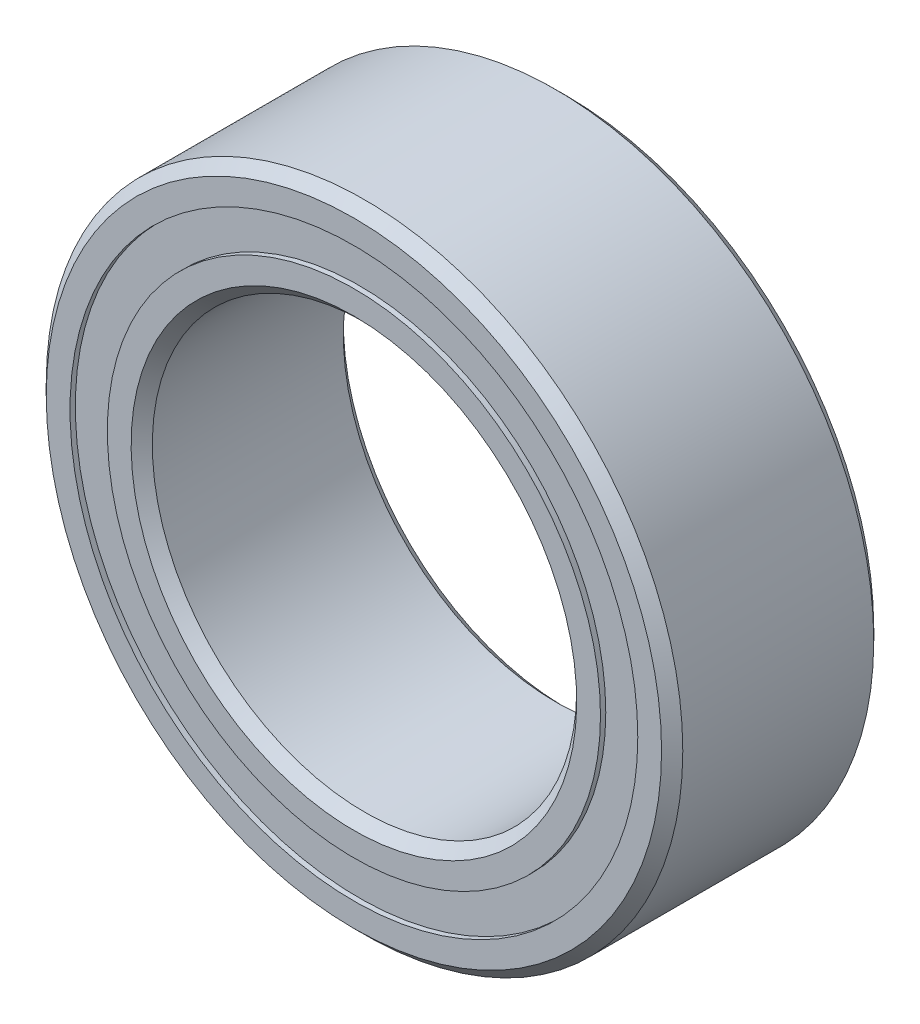
ISO-10303-21;
HEADER;
FILE_DESCRIPTION(('STEP AP214'),'2;1');
FILE_NAME('part.step','',(''),(''),'','','');
FILE_SCHEMA(('AUTOMOTIVE_DESIGN { 1 0 10303 214 1 1 1 1 }'));
ENDSEC;
DATA;
#1=APPLICATION_CONTEXT('core data for automotive mechanical design processes');
#2=APPLICATION_PROTOCOL_DEFINITION('international standard','automotive_design',2000,#1);
#3=PRODUCT_CONTEXT('',#1,'mechanical');
#4=PRODUCT('Part','Part','',(#3));
#5=PRODUCT_RELATED_PRODUCT_CATEGORY('part','',(#4));
#6=PRODUCT_DEFINITION_FORMATION('','',#4);
#7=PRODUCT_DEFINITION_CONTEXT('part definition',#1,'design');
#8=PRODUCT_DEFINITION('design','',#6,#7);
#9=PRODUCT_DEFINITION_SHAPE('','',#8);
#10=(LENGTH_UNIT() NAMED_UNIT(*) SI_UNIT(.MILLI.,.METRE.));
#11=(NAMED_UNIT(*) PLANE_ANGLE_UNIT() SI_UNIT($,.RADIAN.));
#12=(NAMED_UNIT(*) SI_UNIT($,.STERADIAN.) SOLID_ANGLE_UNIT());
#13=UNCERTAINTY_MEASURE_WITH_UNIT(LENGTH_MEASURE(1.E-05),#10,'distance_accuracy_value','');
#14=(GEOMETRIC_REPRESENTATION_CONTEXT(3) GLOBAL_UNCERTAINTY_ASSIGNED_CONTEXT((#13)) GLOBAL_UNIT_ASSIGNED_CONTEXT((#10,
#11,#12)) REPRESENTATION_CONTEXT('',''));
#15=CARTESIAN_POINT('',(0.,0.,0.));
#16=DIRECTION('',(0.,0.,1.));
#17=DIRECTION('',(1.,0.,0.));
#18=AXIS2_PLACEMENT_3D('',#15,#16,#17);
#19=CARTESIAN_POINT('',(-3.43703832126947,1.98437500000004,0.));
#20=DIRECTION('',(-0.866025403784433,0.50000000000001,0.));
#21=DIRECTION('',(0.,0.,1.));
#22=AXIS2_PLACEMENT_3D('',#19,#20,#21);
#23=SPHERICAL_SURFACE('',#22,0.758760243513404);
#24=CARTESIAN_POINT('',(-2.7799326750052,1.60499487824333,0.));
#25=VERTEX_POINT('',#24);
#26=VERTEX_LOOP('',#25);
#27=FACE_BOUND('',#26,.T.);
#28=CARTESIAN_POINT('',(-4.09414396753374,2.36375512175675,0.));
#29=VERTEX_POINT('',#28);
#30=VERTEX_LOOP('',#29);
#31=FACE_BOUND('',#30,.T.);
#32=ADVANCED_FACE('F46',(#27,#31),#23,.T.);
#33=CLOSED_SHELL('',(#32));
#34=MANIFOLD_SOLID_BREP('B2',#33);
#35=CARTESIAN_POINT('',(3.43703832126948,-1.98437500000002,0.));
#36=DIRECTION('',(0.866025403784437,-0.500000000000004,0.));
#37=DIRECTION('',(0.,0.,1.));
#38=AXIS2_PLACEMENT_3D('',#35,#36,#37);
#39=SPHERICAL_SURFACE('',#38,0.758760243513404);
#40=CARTESIAN_POINT('',(4.09414396753376,-2.36375512175672,0.));
#41=VERTEX_POINT('',#40);
#42=VERTEX_LOOP('',#41);
#43=FACE_BOUND('',#42,.T.);
#44=CARTESIAN_POINT('',(2.77993267500521,-1.60499487824331,0.));
#45=VERTEX_POINT('',#44);
#46=VERTEX_LOOP('',#45);
#47=FACE_BOUND('',#46,.T.);
#48=ADVANCED_FACE('F75',(#43,#47),#39,.T.);
#49=CLOSED_SHELL('',(#48));
#50=MANIFOLD_SOLID_BREP('B6',#49);
#51=CARTESIAN_POINT('',(3.96875,0.,0.));
#52=DIRECTION('',(1.,0.,0.));
#53=DIRECTION('',(0.,0.,1.));
#54=AXIS2_PLACEMENT_3D('',#51,#52,#53);
#55=SPHERICAL_SURFACE('',#54,0.758760243513404);
#56=CARTESIAN_POINT('',(3.2099897564866,0.,0.));
#57=VERTEX_POINT('',#56);
#58=VERTEX_LOOP('',#57);
#59=FACE_BOUND('',#58,.T.);
#60=CARTESIAN_POINT('',(4.7275102435134,0.,0.));
#61=VERTEX_POINT('',#60);
#62=VERTEX_LOOP('',#61);
#63=FACE_BOUND('',#62,.T.);
#64=ADVANCED_FACE('F104',(#59,#63),#55,.T.);
#65=CLOSED_SHELL('',(#64));
#66=MANIFOLD_SOLID_BREP('B39',#65);
#67=CARTESIAN_POINT('',(-1.98437500000003,-3.43703832126947,0.));
#68=DIRECTION('',(-0.500000000000007,-0.866025403784435,0.));
#69=DIRECTION('',(0.,0.,1.));
#70=AXIS2_PLACEMENT_3D('',#67,#68,#69);
#71=SPHERICAL_SURFACE('',#70,0.758760243513404);
#72=CARTESIAN_POINT('',(-1.60499487824332,-2.7799326750052,0.));
#73=VERTEX_POINT('',#72);
#74=VERTEX_LOOP('',#73);
#75=FACE_BOUND('',#74,.T.);
#76=CARTESIAN_POINT('',(-2.36375512175674,-4.09414396753375,0.));
#77=VERTEX_POINT('',#76);
#78=VERTEX_LOOP('',#77);
#79=FACE_BOUND('',#78,.T.);
#80=ADVANCED_FACE('F132',(#75,#79),#71,.T.);
#81=CLOSED_SHELL('',(#80));
#82=MANIFOLD_SOLID_BREP('B68',#81);
#83=CARTESIAN_POINT('',(0.,4.24787087912088,-0.758760243513404));
#84=DIRECTION('',(0.,0.,-1.));
#85=DIRECTION('',(1.,0.,0.));
#86=AXIS2_PLACEMENT_3D('',#83,#84,#85);
#87=PLANE('',#86);
#88=CARTESIAN_POINT('',(0.,0.,-0.758760243513404));
#89=DIRECTION('',(0.,0.,1.));
#90=DIRECTION('',(1.,0.,0.));
#91=AXIS2_PLACEMENT_3D('',#88,#89,#90);
#92=CIRCLE('',#91,3.68962912087912);
#93=CARTESIAN_POINT('',(3.68962912087912,0.,-0.758760243513404));
#94=VERTEX_POINT('',#93);
#95=EDGE_CURVE('E164',#94,#94,#92,.T.);
#96=ORIENTED_EDGE('',*,*,#95,.F.);
#97=EDGE_LOOP('',(#96));
#98=FACE_BOUND('',#97,.T.);
#99=CARTESIAN_POINT('',(0.,0.,-0.758760243513404));
#100=DIRECTION('',(0.,0.,1.));
#101=DIRECTION('',(1.,0.,0.));
#102=AXIS2_PLACEMENT_3D('',#99,#100,#101);
#103=CIRCLE('',#102,4.24787087912088);
#104=CARTESIAN_POINT('',(4.24787087912088,0.,-0.758760243513404));
#105=VERTEX_POINT('',#104);
#106=EDGE_CURVE('E173',#105,#105,#103,.T.);
#107=ORIENTED_EDGE('',*,*,#106,.T.);
#108=EDGE_LOOP('',(#107));
#109=FACE_BOUND('',#108,.T.);
#110=ADVANCED_FACE('F161',(#98,#109),#87,.F.);
#111=CARTESIAN_POINT('',(0.,0.,-1.5875));
#112=DIRECTION('',(0.,0.,-1.));
#113=DIRECTION('',(1.,0.,0.));
#114=AXIS2_PLACEMENT_3D('',#111,#112,#113);
#115=CYLINDRICAL_SURFACE('',#114,3.68962912087912);
#116=ORIENTED_EDGE('',*,*,#95,.T.);
#117=EDGE_LOOP('',(#116));
#118=FACE_BOUND('',#117,.T.);
#119=CARTESIAN_POINT('',(0.,0.,-1.508125));
#120=DIRECTION('',(0.,0.,1.));
#121=DIRECTION('',(1.,0.,0.));
#122=AXIS2_PLACEMENT_3D('',#119,#120,#121);
#123=CIRCLE('',#122,3.68962912087912);
#124=CARTESIAN_POINT('',(3.68962912087912,0.,-1.508125));
#125=VERTEX_POINT('',#124);
#126=EDGE_CURVE('E168',#125,#125,#123,.T.);
#127=ORIENTED_EDGE('',*,*,#126,.F.);
#128=EDGE_LOOP('',(#127));
#129=FACE_BOUND('',#128,.T.);
#130=ADVANCED_FACE('F181',(#118,#129),#115,.F.);
#131=CARTESIAN_POINT('',(0.,0.,-1.5875));
#132=DIRECTION('',(0.,0.,-1.));
#133=DIRECTION('',(1.,0.,0.));
#134=AXIS2_PLACEMENT_3D('',#131,#132,#133);
#135=CYLINDRICAL_SURFACE('',#134,4.24787087912088);
#136=CARTESIAN_POINT('',(0.,0.,-1.508125));
#137=DIRECTION('',(0.,0.,1.));
#138=DIRECTION('',(1.,0.,0.));
#139=AXIS2_PLACEMENT_3D('',#136,#137,#138);
#140=CIRCLE('',#139,4.24787087912088);
#141=CARTESIAN_POINT('',(4.24787087912088,0.,-1.508125));
#142=VERTEX_POINT('',#141);
#143=EDGE_CURVE('E131',#142,#142,#140,.F.);
#144=ORIENTED_EDGE('',*,*,#143,.F.);
#145=EDGE_LOOP('',(#144));
#146=FACE_BOUND('',#145,.T.);
#147=ORIENTED_EDGE('',*,*,#106,.F.);
#148=EDGE_LOOP('',(#147));
#149=FACE_BOUND('',#148,.T.);
#150=ADVANCED_FACE('F188',(#146,#149),#135,.T.);
#151=CARTESIAN_POINT('',(0.,4.24787087912088,-1.508125));
#152=DIRECTION('',(0.,0.,1.));
#153=DIRECTION('',(-1.,0.,0.));
#154=AXIS2_PLACEMENT_3D('',#151,#152,#153);
#155=PLANE('',#154);
#156=ORIENTED_EDGE('',*,*,#143,.T.);
#157=EDGE_LOOP('',(#156));
#158=FACE_BOUND('',#157,.T.);
#159=ORIENTED_EDGE('',*,*,#126,.T.);
#160=EDGE_LOOP('',(#159));
#161=FACE_BOUND('',#160,.T.);
#162=ADVANCED_FACE('F192',(#158,#161),#155,.F.);
#163=CLOSED_SHELL('',(#110,#130,#150,#162));
#164=MANIFOLD_SOLID_BREP('B97',#163);
#165=CARTESIAN_POINT('',(-3.43703832126951,-1.98437499999997,0.));
#166=DIRECTION('',(-0.866025403784443,-0.499999999999992,0.));
#167=DIRECTION('',(0.,0.,1.));
#168=AXIS2_PLACEMENT_3D('',#165,#166,#167);
#169=SPHERICAL_SURFACE('',#168,0.758760243513404);
#170=CARTESIAN_POINT('',(-4.09414396753379,-2.36375512175666,0.));
#171=VERTEX_POINT('',#170);
#172=VERTEX_LOOP('',#171);
#173=FACE_BOUND('',#172,.T.);
#174=CARTESIAN_POINT('',(-2.77993267500523,-1.60499487824327,0.));
#175=VERTEX_POINT('',#174);
#176=VERTEX_LOOP('',#175);
#177=FACE_BOUND('',#176,.T.);
#178=ADVANCED_FACE('F232',(#173,#177),#169,.T.);
#179=CLOSED_SHELL('',(#178));
#180=MANIFOLD_SOLID_BREP('B126',#179);
#181=CARTESIAN_POINT('',(-1.98437499999996,3.43703832126952,0.));
#182=DIRECTION('',(-0.499999999999989,0.866025403784445,0.));
#183=DIRECTION('',(0.,0.,1.));
#184=AXIS2_PLACEMENT_3D('',#181,#182,#183);
#185=SPHERICAL_SURFACE('',#184,0.758760243513404);
#186=CARTESIAN_POINT('',(-2.36375512175665,4.0941439675338,0.));
#187=VERTEX_POINT('',#186);
#188=VERTEX_LOOP('',#187);
#189=FACE_BOUND('',#188,.T.);
#190=CARTESIAN_POINT('',(-1.60499487824326,2.77993267500524,0.));
#191=VERTEX_POINT('',#190);
#192=VERTEX_LOOP('',#191);
#193=FACE_BOUND('',#192,.T.);
#194=ADVANCED_FACE('F261',(#189,#193),#185,.T.);
#195=CLOSED_SHELL('',(#194));
#196=MANIFOLD_SOLID_BREP('B154',#195);
#197=CARTESIAN_POINT('',(-3.96875,0.,0.));
#198=DIRECTION('',(-1.,0.,0.));
#199=DIRECTION('',(0.,0.,1.));
#200=AXIS2_PLACEMENT_3D('',#197,#198,#199);
#201=SPHERICAL_SURFACE('',#200,0.758760243513404);
#202=CARTESIAN_POINT('',(-4.7275102435134,0.,0.));
#203=VERTEX_POINT('',#202);
#204=VERTEX_LOOP('',#203);
#205=FACE_BOUND('',#204,.T.);
#206=CARTESIAN_POINT('',(-3.2099897564866,0.,0.));
#207=VERTEX_POINT('',#206);
#208=VERTEX_LOOP('',#207);
#209=FACE_BOUND('',#208,.T.);
#210=ADVANCED_FACE('F289',(#205,#209),#201,.T.);
#211=CLOSED_SHELL('',(#210));
#212=MANIFOLD_SOLID_BREP('B225',#211);
#213=CARTESIAN_POINT('',(0.,0.,0.));
#214=DIRECTION('',(0.,0.,-1.));
#215=DIRECTION('',(1.,0.,0.));
#216=AXIS2_PLACEMENT_3D('',#213,#214,#215);
#217=TOROIDAL_SURFACE('',#216,3.96875,0.758760243513404);
#218=CARTESIAN_POINT('',(0.,0.,0.705555555555556));
#219=DIRECTION('',(0.,0.,1.));
#220=DIRECTION('',(1.,0.,0.));
#221=AXIS2_PLACEMENT_3D('',#218,#219,#220);
#222=CIRCLE('',#221,4.24787087912088);
#223=CARTESIAN_POINT('',(4.24787087912088,0.,0.705555555555556));
#224=VERTEX_POINT('',#223);
#225=EDGE_CURVE('E336',#224,#224,#222,.F.);
#226=ORIENTED_EDGE('',*,*,#225,.F.);
#227=EDGE_LOOP('',(#226));
#228=FACE_BOUND('',#227,.T.);
#229=CARTESIAN_POINT('',(0.,0.,-0.705555555555555));
#230=DIRECTION('',(0.,0.,1.));
#231=DIRECTION('',(1.,0.,0.));
#232=AXIS2_PLACEMENT_3D('',#229,#230,#231);
#233=CIRCLE('',#232,4.24787087912088);
#234=CARTESIAN_POINT('',(4.24787087912088,0.,-0.705555555555555));
#235=VERTEX_POINT('',#234);
#236=EDGE_CURVE('E334',#235,#235,#233,.T.);
#237=ORIENTED_EDGE('',*,*,#236,.F.);
#238=EDGE_LOOP('',(#237));
#239=FACE_BOUND('',#238,.T.);
#240=ADVANCED_FACE('F318',(#228,#239),#217,.F.);
#241=CARTESIAN_POINT('',(0.,0.,-1.5875));
#242=DIRECTION('',(0.,0.,-1.));
#243=DIRECTION('',(1.,0.,0.));
#244=AXIS2_PLACEMENT_3D('',#241,#242,#243);
#245=CYLINDRICAL_SURFACE('',#244,4.24787087912088);
#246=CARTESIAN_POINT('',(0.,0.,1.5875));
#247=DIRECTION('',(0.,0.,1.));
#248=DIRECTION('',(1.,0.,0.));
#249=AXIS2_PLACEMENT_3D('',#246,#247,#248);
#250=CIRCLE('',#249,4.24787087912088);
#251=CARTESIAN_POINT('',(4.24787087912088,0.,1.5875));
#252=VERTEX_POINT('',#251);
#253=EDGE_CURVE('E322',#252,#252,#250,.F.);
#254=ORIENTED_EDGE('',*,*,#253,.F.);
#255=EDGE_LOOP('',(#254));
#256=FACE_BOUND('',#255,.T.);
#257=ORIENTED_EDGE('',*,*,#225,.T.);
#258=EDGE_LOOP('',(#257));
#259=FACE_BOUND('',#258,.T.);
#260=ADVANCED_FACE('F355',(#256,#259),#245,.F.);
#261=CARTESIAN_POINT('',(0.,0.,-1.5875));
#262=DIRECTION('',(0.,0.,-1.));
#263=DIRECTION('',(1.,0.,0.));
#264=AXIS2_PLACEMENT_3D('',#261,#262,#263);
#265=CYLINDRICAL_SURFACE('',#264,4.24787087912088);
#266=ORIENTED_EDGE('',*,*,#236,.T.);
#267=EDGE_LOOP('',(#266));
#268=FACE_BOUND('',#267,.T.);
#269=CARTESIAN_POINT('',(0.,0.,-1.5875));
#270=DIRECTION('',(0.,0.,1.));
#271=DIRECTION('',(1.,0.,0.));
#272=AXIS2_PLACEMENT_3D('',#269,#270,#271);
#273=CIRCLE('',#272,4.24787087912088);
#274=CARTESIAN_POINT('',(4.24787087912088,0.,-1.5875));
#275=VERTEX_POINT('',#274);
#276=EDGE_CURVE('E345',#275,#275,#273,.T.);
#277=ORIENTED_EDGE('',*,*,#276,.F.);
#278=EDGE_LOOP('',(#277));
#279=FACE_BOUND('',#278,.T.);
#280=ADVANCED_FACE('F358',(#268,#279),#265,.F.);
#281=CARTESIAN_POINT('',(0.,4.60375,1.5875));
#282=DIRECTION('',(0.,0.,-1.));
#283=DIRECTION('',(1.,0.,0.));
#284=AXIS2_PLACEMENT_3D('',#281,#282,#283);
#285=PLANE('',#284);
#286=ORIENTED_EDGE('',*,*,#253,.T.);
#287=EDGE_LOOP('',(#286));
#288=FACE_BOUND('',#287,.T.);
#289=CARTESIAN_POINT('',(0.,0.,1.58750000002783));
#290=DIRECTION('',(0.,0.,1.));
#291=DIRECTION('',(1.,0.,0.));
#292=AXIS2_PLACEMENT_3D('',#289,#290,#291);
#293=CIRCLE('',#292,4.60375000000113);
#294=CARTESIAN_POINT('',(4.60375000000113,0.,1.58750000002783));
#295=VERTEX_POINT('',#294);
#296=EDGE_CURVE('E343',#295,#295,#293,.T.);
#297=ORIENTED_EDGE('',*,*,#296,.T.);
#298=EDGE_LOOP('',(#297));
#299=FACE_BOUND('',#298,.T.);
#300=ADVANCED_FACE('F352',(#288,#299),#285,.F.);
#301=CARTESIAN_POINT('',(0.,4.60375,-1.5875));
#302=DIRECTION('',(0.,0.,1.));
#303=DIRECTION('',(-1.,0.,0.));
#304=AXIS2_PLACEMENT_3D('',#301,#302,#303);
#305=PLANE('',#304);
#306=CARTESIAN_POINT('',(0.,0.,-1.58750000008467));
#307=DIRECTION('',(0.,0.,-1.));
#308=DIRECTION('',(-1.,0.,0.));
#309=AXIS2_PLACEMENT_3D('',#306,#307,#308);
#310=CIRCLE('',#309,4.60375000000113);
#311=CARTESIAN_POINT('',(-4.60375000000113,0.,-1.58750000008467));
#312=VERTEX_POINT('',#311);
#313=EDGE_CURVE('E331',#312,#312,#310,.T.);
#314=ORIENTED_EDGE('',*,*,#313,.T.);
#315=EDGE_LOOP('',(#314));
#316=FACE_BOUND('',#315,.T.);
#317=ORIENTED_EDGE('',*,*,#276,.T.);
#318=EDGE_LOOP('',(#317));
#319=FACE_BOUND('',#318,.T.);
#320=ADVANCED_FACE('F371',(#316,#319),#305,.F.);
#321=CARTESIAN_POINT('',(0.,0.,1.42874999994547));
#322=DIRECTION('',(0.,0.,-1.));
#323=DIRECTION('',(1.,0.,0.));
#324=AXIS2_PLACEMENT_3D('',#321,#322,#323);
#325=CONICAL_SURFACE('',#324,4.76250000002665,0.785398163218414);
#326=CARTESIAN_POINT('',(0.,0.,1.42875));
#327=DIRECTION('',(0.,0.,1.));
#328=DIRECTION('',(1.,0.,0.));
#329=AXIS2_PLACEMENT_3D('',#326,#327,#328);
#330=CIRCLE('',#329,4.7625);
#331=CARTESIAN_POINT('',(4.7625,0.,1.42875));
#332=VERTEX_POINT('',#331);
#333=EDGE_CURVE('E326',#332,#332,#330,.T.);
#334=ORIENTED_EDGE('',*,*,#333,.T.);
#335=EDGE_LOOP('',(#334));
#336=FACE_BOUND('',#335,.T.);
#337=ORIENTED_EDGE('',*,*,#296,.F.);
#338=EDGE_LOOP('',(#337));
#339=FACE_BOUND('',#338,.T.);
#340=ADVANCED_FACE('F376',(#336,#339),#325,.T.);
#341=CARTESIAN_POINT('',(0.,0.,-1.42875000005915));
#342=DIRECTION('',(0.,0.,1.));
#343=DIRECTION('',(-1.,0.,0.));
#344=AXIS2_PLACEMENT_3D('',#341,#342,#343);
#345=CONICAL_SURFACE('',#344,4.7624999999698,0.785398163218414);
#346=CARTESIAN_POINT('',(0.,0.,-1.42875));
#347=DIRECTION('',(0.,0.,1.));
#348=DIRECTION('',(1.,0.,0.));
#349=AXIS2_PLACEMENT_3D('',#346,#347,#348);
#350=CIRCLE('',#349,4.7625);
#351=CARTESIAN_POINT('',(4.7625,0.,-1.42875));
#352=VERTEX_POINT('',#351);
#353=EDGE_CURVE('E288',#352,#352,#350,.F.);
#354=ORIENTED_EDGE('',*,*,#353,.T.);
#355=EDGE_LOOP('',(#354));
#356=FACE_BOUND('',#355,.T.);
#357=ORIENTED_EDGE('',*,*,#313,.F.);
#358=EDGE_LOOP('',(#357));
#359=FACE_BOUND('',#358,.T.);
#360=ADVANCED_FACE('F380',(#356,#359),#345,.T.);
#361=CARTESIAN_POINT('',(0.,0.,-1.5875));
#362=DIRECTION('',(0.,0.,-1.));
#363=DIRECTION('',(1.,0.,0.));
#364=AXIS2_PLACEMENT_3D('',#361,#362,#363);
#365=CYLINDRICAL_SURFACE('',#364,4.7625);
#366=ORIENTED_EDGE('',*,*,#353,.F.);
#367=EDGE_LOOP('',(#366));
#368=FACE_BOUND('',#367,.T.);
#369=ORIENTED_EDGE('',*,*,#333,.F.);
#370=EDGE_LOOP('',(#369));
#371=FACE_BOUND('',#370,.T.);
#372=ADVANCED_FACE('F384',(#368,#371),#365,.T.);
#373=CLOSED_SHELL('',(#240,#260,#280,#300,#320,#340,#360,#372));
#374=MANIFOLD_SOLID_BREP('B254',#373);
#375=CARTESIAN_POINT('',(1.98437499999998,-3.4370383212695,0.));
#376=DIRECTION('',(0.499999999999995,-0.866025403784442,0.));
#377=DIRECTION('',(0.,0.,1.));
#378=AXIS2_PLACEMENT_3D('',#375,#376,#377);
#379=SPHERICAL_SURFACE('',#378,0.758760243513404);
#380=CARTESIAN_POINT('',(2.36375512175668,-4.09414396753378,0.));
#381=VERTEX_POINT('',#380);
#382=VERTEX_LOOP('',#381);
#383=FACE_BOUND('',#382,.T.);
#384=CARTESIAN_POINT('',(1.60499487824328,-2.77993267500523,0.));
#385=VERTEX_POINT('',#384);
#386=VERTEX_LOOP('',#385);
#387=FACE_BOUND('',#386,.T.);
#388=ADVANCED_FACE('F450',(#383,#387),#379,.T.);
#389=CLOSED_SHELL('',(#388));
#390=MANIFOLD_SOLID_BREP('B283',#389);
#391=CARTESIAN_POINT('',(0.,0.,0.));
#392=DIRECTION('',(0.,0.,-1.));
#393=DIRECTION('',(1.,0.,0.));
#394=AXIS2_PLACEMENT_3D('',#391,#392,#393);
#395=TOROIDAL_SURFACE('',#394,3.96875,0.758760243513403);
#396=CARTESIAN_POINT('',(0.,0.,-0.705555555555556));
#397=DIRECTION('',(0.,0.,1.));
#398=DIRECTION('',(1.,0.,0.));
#399=AXIS2_PLACEMENT_3D('',#396,#397,#398);
#400=CIRCLE('',#399,3.68962912087912);
#401=CARTESIAN_POINT('',(3.68962912087912,0.,-0.705555555555556));
#402=VERTEX_POINT('',#401);
#403=EDGE_CURVE('E497',#402,#402,#400,.T.);
#404=ORIENTED_EDGE('',*,*,#403,.T.);
#405=EDGE_LOOP('',(#404));
#406=FACE_BOUND('',#405,.T.);
#407=CARTESIAN_POINT('',(0.,0.,0.705555555555556));
#408=DIRECTION('',(0.,0.,1.));
#409=DIRECTION('',(1.,0.,0.));
#410=AXIS2_PLACEMENT_3D('',#407,#408,#409);
#411=CIRCLE('',#410,3.68962912087912);
#412=CARTESIAN_POINT('',(3.68962912087912,0.,0.705555555555556));
#413=VERTEX_POINT('',#412);
#414=EDGE_CURVE('E495',#413,#413,#411,.F.);
#415=ORIENTED_EDGE('',*,*,#414,.T.);
#416=EDGE_LOOP('',(#415));
#417=FACE_BOUND('',#416,.T.);
#418=ADVANCED_FACE('F479',(#406,#417),#395,.F.);
#419=CARTESIAN_POINT('',(0.,0.,-1.5875));
#420=DIRECTION('',(0.,0.,-1.));
#421=DIRECTION('',(1.,0.,0.));
#422=AXIS2_PLACEMENT_3D('',#419,#420,#421);
#423=CYLINDRICAL_SURFACE('',#422,3.68962912087912);
#424=CARTESIAN_POINT('',(0.,0.,-1.5875));
#425=DIRECTION('',(0.,0.,1.));
#426=DIRECTION('',(1.,0.,0.));
#427=AXIS2_PLACEMENT_3D('',#424,#425,#426);
#428=CIRCLE('',#427,3.68962912087912);
#429=CARTESIAN_POINT('',(3.68962912087912,0.,-1.5875));
#430=VERTEX_POINT('',#429);
#431=EDGE_CURVE('E483',#430,#430,#428,.F.);
#432=ORIENTED_EDGE('',*,*,#431,.F.);
#433=EDGE_LOOP('',(#432));
#434=FACE_BOUND('',#433,.T.);
#435=ORIENTED_EDGE('',*,*,#403,.F.);
#436=EDGE_LOOP('',(#435));
#437=FACE_BOUND('',#436,.T.);
#438=ADVANCED_FACE('F516',(#434,#437),#423,.T.);
#439=CARTESIAN_POINT('',(0.,0.,-1.5875));
#440=DIRECTION('',(0.,0.,-1.));
#441=DIRECTION('',(1.,0.,0.));
#442=AXIS2_PLACEMENT_3D('',#439,#440,#441);
#443=CYLINDRICAL_SURFACE('',#442,3.68962912087912);
#444=ORIENTED_EDGE('',*,*,#414,.F.);
#445=EDGE_LOOP('',(#444));
#446=FACE_BOUND('',#445,.T.);
#447=CARTESIAN_POINT('',(0.,0.,1.5875));
#448=DIRECTION('',(0.,0.,1.));
#449=DIRECTION('',(1.,0.,0.));
#450=AXIS2_PLACEMENT_3D('',#447,#448,#449);
#451=CIRCLE('',#450,3.68962912087912);
#452=CARTESIAN_POINT('',(3.68962912087912,0.,1.5875));
#453=VERTEX_POINT('',#452);
#454=EDGE_CURVE('E506',#453,#453,#451,.T.);
#455=ORIENTED_EDGE('',*,*,#454,.F.);
#456=EDGE_LOOP('',(#455));
#457=FACE_BOUND('',#456,.T.);
#458=ADVANCED_FACE('F519',(#446,#457),#443,.T.);
#459=CARTESIAN_POINT('',(0.,3.68962912087912,-1.5875));
#460=DIRECTION('',(0.,0.,1.));
#461=DIRECTION('',(-1.,0.,0.));
#462=AXIS2_PLACEMENT_3D('',#459,#460,#461);
#463=PLANE('',#462);
#464=ORIENTED_EDGE('',*,*,#431,.T.);
#465=EDGE_LOOP('',(#464));
#466=FACE_BOUND('',#465,.T.);
#467=CARTESIAN_POINT('',(0.,0.,-1.58749999997099));
#468=DIRECTION('',(0.,0.,1.));
#469=DIRECTION('',(1.,0.,0.));
#470=AXIS2_PLACEMENT_3D('',#467,#468,#469);
#471=CIRCLE('',#470,3.33374999996749);
#472=CARTESIAN_POINT('',(3.33374999996749,0.,-1.58749999997099));
#473=VERTEX_POINT('',#472);
#474=EDGE_CURVE('E504',#473,#473,#471,.F.);
#475=ORIENTED_EDGE('',*,*,#474,.F.);
#476=EDGE_LOOP('',(#475));
#477=FACE_BOUND('',#476,.T.);
#478=ADVANCED_FACE('F513',(#466,#477),#463,.F.);
#479=CARTESIAN_POINT('',(0.,3.33375,1.5875));
#480=DIRECTION('',(0.,0.,-1.));
#481=DIRECTION('',(1.,0.,0.));
#482=AXIS2_PLACEMENT_3D('',#479,#480,#481);
#483=PLANE('',#482);
#484=CARTESIAN_POINT('',(0.,0.,1.58749999997099));
#485=DIRECTION('',(0.,0.,-1.));
#486=DIRECTION('',(0.,1.,0.));
#487=AXIS2_PLACEMENT_3D('',#484,#485,#486);
#488=CIRCLE('',#487,3.33375000002434);
#489=CARTESIAN_POINT('',(0.,3.33375000002434,1.58749999997099));
#490=VERTEX_POINT('',#489);
#491=EDGE_CURVE('E492',#490,#490,#488,.F.);
#492=ORIENTED_EDGE('',*,*,#491,.F.);
#493=EDGE_LOOP('',(#492));
#494=FACE_BOUND('',#493,.T.);
#495=ORIENTED_EDGE('',*,*,#454,.T.);
#496=EDGE_LOOP('',(#495));
#497=FACE_BOUND('',#496,.T.);
#498=ADVANCED_FACE('F532',(#494,#497),#483,.F.);
#499=CARTESIAN_POINT('',(0.,0.,-1.58749999991414));
#500=DIRECTION('',(0.,0.,-1.));
#501=DIRECTION('',(1.,0.,0.));
#502=AXIS2_PLACEMENT_3D('',#499,#500,#501);
#503=CONICAL_SURFACE('',#502,3.33374999991065,0.785398163397448);
#504=ORIENTED_EDGE('',*,*,#474,.T.);
#505=EDGE_LOOP('',(#504));
#506=FACE_BOUND('',#505,.T.);
#507=CARTESIAN_POINT('',(0.,0.,-1.42875));
#508=DIRECTION('',(0.,0.,1.));
#509=DIRECTION('',(1.,0.,0.));
#510=AXIS2_PLACEMENT_3D('',#507,#508,#509);
#511=CIRCLE('',#510,3.175);
#512=CARTESIAN_POINT('',(3.175,0.,-1.42875));
#513=VERTEX_POINT('',#512);
#514=EDGE_CURVE('E487',#513,#513,#511,.F.);
#515=ORIENTED_EDGE('',*,*,#514,.F.);
#516=EDGE_LOOP('',(#515));
#517=FACE_BOUND('',#516,.T.);
#518=ADVANCED_FACE('F537',(#506,#517),#503,.F.);
#519=CARTESIAN_POINT('',(0.,0.,1.58749999997099));
#520=DIRECTION('',(0.,0.,1.));
#521=DIRECTION('',(0.,1.,0.));
#522=AXIS2_PLACEMENT_3D('',#519,#520,#521);
#523=CONICAL_SURFACE('',#522,3.33375000002434,0.785398163397448);
#524=CARTESIAN_POINT('',(0.,0.,1.42875));
#525=DIRECTION('',(0.,0.,1.));
#526=DIRECTION('',(1.,0.,0.));
#527=AXIS2_PLACEMENT_3D('',#524,#525,#526);
#528=CIRCLE('',#527,3.175);
#529=CARTESIAN_POINT('',(3.175,0.,1.42875));
#530=VERTEX_POINT('',#529);
#531=EDGE_CURVE('E449',#530,#530,#528,.T.);
#532=ORIENTED_EDGE('',*,*,#531,.F.);
#533=EDGE_LOOP('',(#532));
#534=FACE_BOUND('',#533,.T.);
#535=ORIENTED_EDGE('',*,*,#491,.T.);
#536=EDGE_LOOP('',(#535));
#537=FACE_BOUND('',#536,.T.);
#538=ADVANCED_FACE('F541',(#534,#537),#523,.F.);
#539=CARTESIAN_POINT('',(0.,0.,-1.5875));
#540=DIRECTION('',(0.,0.,-1.));
#541=DIRECTION('',(1.,0.,0.));
#542=AXIS2_PLACEMENT_3D('',#539,#540,#541);
#543=CYLINDRICAL_SURFACE('',#542,3.175);
#544=ORIENTED_EDGE('',*,*,#514,.T.);
#545=EDGE_LOOP('',(#544));
#546=FACE_BOUND('',#545,.T.);
#547=ORIENTED_EDGE('',*,*,#531,.T.);
#548=EDGE_LOOP('',(#547));
#549=FACE_BOUND('',#548,.T.);
#550=ADVANCED_FACE('F545',(#546,#549),#543,.F.);
#551=CLOSED_SHELL('',(#418,#438,#458,#478,#498,#518,#538,#550));
#552=MANIFOLD_SOLID_BREP('B311',#551);
#553=CARTESIAN_POINT('',(3.4370383212695,1.98437499999999,0.));
#554=DIRECTION('',(0.86602540378444,0.499999999999998,0.));
#555=DIRECTION('',(0.,0.,1.));
#556=AXIS2_PLACEMENT_3D('',#553,#554,#555);
#557=SPHERICAL_SURFACE('',#556,0.758760243513404);
#558=CARTESIAN_POINT('',(4.09414396753377,2.36375512175669,0.));
#559=VERTEX_POINT('',#558);
#560=VERTEX_LOOP('',#559);
#561=FACE_BOUND('',#560,.T.);
#562=CARTESIAN_POINT('',(2.77993267500522,1.60499487824329,0.));
#563=VERTEX_POINT('',#562);
#564=VERTEX_LOOP('',#563);
#565=FACE_BOUND('',#564,.T.);
#566=ADVANCED_FACE('F612',(#561,#565),#557,.T.);
#567=CLOSED_SHELL('',(#566));
#568=MANIFOLD_SOLID_BREP('B444',#567);
#569=CARTESIAN_POINT('',(1.984375,3.43703832126949,0.));
#570=DIRECTION('',(0.500000000000001,0.866025403784438,0.));
#571=DIRECTION('',(0.,0.,1.));
#572=AXIS2_PLACEMENT_3D('',#569,#570,#571);
#573=SPHERICAL_SURFACE('',#572,0.758760243513404);
#574=CARTESIAN_POINT('',(2.36375512175671,4.09414396753376,0.));
#575=VERTEX_POINT('',#574);
#576=VERTEX_LOOP('',#575);
#577=FACE_BOUND('',#576,.T.);
#578=CARTESIAN_POINT('',(1.6049948782433,2.77993267500521,0.));
#579=VERTEX_POINT('',#578);
#580=VERTEX_LOOP('',#579);
#581=FACE_BOUND('',#580,.T.);
#582=ADVANCED_FACE('F640',(#577,#581),#573,.T.);
#583=CLOSED_SHELL('',(#582));
#584=MANIFOLD_SOLID_BREP('B472',#583);
#585=CARTESIAN_POINT('',(0.,4.24787087912088,1.508125));
#586=DIRECTION('',(0.,0.,-1.));
#587=DIRECTION('',(1.,0.,0.));
#588=AXIS2_PLACEMENT_3D('',#585,#586,#587);
#589=PLANE('',#588);
#590=CARTESIAN_POINT('',(0.,0.,1.508125));
#591=DIRECTION('',(0.,0.,1.));
#592=DIRECTION('',(1.,0.,0.));
#593=AXIS2_PLACEMENT_3D('',#590,#591,#592);
#594=CIRCLE('',#593,3.68962912087912);
#595=CARTESIAN_POINT('',(3.68962912087912,0.,1.508125));
#596=VERTEX_POINT('',#595);
#597=EDGE_CURVE('E672',#596,#596,#594,.T.);
#598=ORIENTED_EDGE('',*,*,#597,.F.);
#599=EDGE_LOOP('',(#598));
#600=FACE_BOUND('',#599,.T.);
#601=CARTESIAN_POINT('',(0.,0.,1.508125));
#602=DIRECTION('',(0.,0.,1.));
#603=DIRECTION('',(1.,0.,0.));
#604=AXIS2_PLACEMENT_3D('',#601,#602,#603);
#605=CIRCLE('',#604,4.24787087912088);
#606=CARTESIAN_POINT('',(4.24787087912088,0.,1.508125));
#607=VERTEX_POINT('',#606);
#608=EDGE_CURVE('E681',#607,#607,#605,.T.);
#609=ORIENTED_EDGE('',*,*,#608,.T.);
#610=EDGE_LOOP('',(#609));
#611=FACE_BOUND('',#610,.T.);
#612=ADVANCED_FACE('F669',(#600,#611),#589,.F.);
#613=CARTESIAN_POINT('',(0.,0.,-1.5875));
#614=DIRECTION('',(0.,0.,-1.));
#615=DIRECTION('',(1.,0.,0.));
#616=AXIS2_PLACEMENT_3D('',#613,#614,#615);
#617=CYLINDRICAL_SURFACE('',#616,3.68962912087912);
#618=ORIENTED_EDGE('',*,*,#597,.T.);
#619=EDGE_LOOP('',(#618));
#620=FACE_BOUND('',#619,.T.);
#621=CARTESIAN_POINT('',(0.,0.,0.758760243513405));
#622=DIRECTION('',(0.,0.,1.));
#623=DIRECTION('',(1.,0.,0.));
#624=AXIS2_PLACEMENT_3D('',#621,#622,#623);
#625=CIRCLE('',#624,3.68962912087912);
#626=CARTESIAN_POINT('',(3.68962912087912,0.,0.758760243513405));
#627=VERTEX_POINT('',#626);
#628=EDGE_CURVE('E676',#627,#627,#625,.T.);
#629=ORIENTED_EDGE('',*,*,#628,.F.);
#630=EDGE_LOOP('',(#629));
#631=FACE_BOUND('',#630,.T.);
#632=ADVANCED_FACE('F689',(#620,#631),#617,.F.);
#633=CARTESIAN_POINT('',(0.,0.,-1.5875));
#634=DIRECTION('',(0.,0.,-1.));
#635=DIRECTION('',(1.,0.,0.));
#636=AXIS2_PLACEMENT_3D('',#633,#634,#635);
#637=CYLINDRICAL_SURFACE('',#636,4.24787087912088);
#638=CARTESIAN_POINT('',(0.,0.,0.758760243513404));
#639=DIRECTION('',(0.,0.,1.));
#640=DIRECTION('',(1.,0.,0.));
#641=AXIS2_PLACEMENT_3D('',#638,#639,#640);
#642=CIRCLE('',#641,4.24787087912088);
#643=CARTESIAN_POINT('',(4.24787087912088,0.,0.758760243513404));
#644=VERTEX_POINT('',#643);
#645=EDGE_CURVE('E639',#644,#644,#642,.F.);
#646=ORIENTED_EDGE('',*,*,#645,.F.);
#647=EDGE_LOOP('',(#646));
#648=FACE_BOUND('',#647,.T.);
#649=ORIENTED_EDGE('',*,*,#608,.F.);
#650=EDGE_LOOP('',(#649));
#651=FACE_BOUND('',#650,.T.);
#652=ADVANCED_FACE('F696',(#648,#651),#637,.T.);
#653=CARTESIAN_POINT('',(0.,4.24787087912088,0.758760243513404));
#654=DIRECTION('',(0.,0.,1.));
#655=DIRECTION('',(-1.,0.,0.));
#656=AXIS2_PLACEMENT_3D('',#653,#654,#655);
#657=PLANE('',#656);
#658=ORIENTED_EDGE('',*,*,#645,.T.);
#659=EDGE_LOOP('',(#658));
#660=FACE_BOUND('',#659,.T.);
#661=ORIENTED_EDGE('',*,*,#628,.T.);
#662=EDGE_LOOP('',(#661));
#663=FACE_BOUND('',#662,.T.);
#664=ADVANCED_FACE('F700',(#660,#663),#657,.F.);
#665=CLOSED_SHELL('',(#612,#632,#652,#664));
#666=MANIFOLD_SOLID_BREP('B605',#665);
#667=CARTESIAN_POINT('',(0.,3.96875,0.));
#668=DIRECTION('',(0.,1.,0.));
#669=DIRECTION('',(0.,0.,1.));
#670=AXIS2_PLACEMENT_3D('',#667,#668,#669);
#671=SPHERICAL_SURFACE('',#670,0.758760243513404);
#672=CARTESIAN_POINT('',(0.,3.2099897564866,0.));
#673=VERTEX_POINT('',#672);
#674=VERTEX_LOOP('',#673);
#675=FACE_BOUND('',#674,.T.);
#676=CARTESIAN_POINT('',(0.,4.7275102435134,0.));
#677=VERTEX_POINT('',#676);
#678=VERTEX_LOOP('',#677);
#679=FACE_BOUND('',#678,.T.);
#680=ADVANCED_FACE('F739',(#675,#679),#671,.T.);
#681=CLOSED_SHELL('',(#680));
#682=MANIFOLD_SOLID_BREP('B634',#681);
#683=CARTESIAN_POINT('',(0.,-3.96875,0.));
#684=DIRECTION('',(0.,-1.,0.));
#685=DIRECTION('',(0.,0.,1.));
#686=AXIS2_PLACEMENT_3D('',#683,#684,#685);
#687=SPHERICAL_SURFACE('',#686,0.758760243513404);
#688=CARTESIAN_POINT('',(0.,-3.2099897564866,0.));
#689=VERTEX_POINT('',#688);
#690=VERTEX_LOOP('',#689);
#691=FACE_BOUND('',#690,.T.);
#692=CARTESIAN_POINT('',(0.,-4.7275102435134,0.));
#693=VERTEX_POINT('',#692);
#694=VERTEX_LOOP('',#693);
#695=FACE_BOUND('',#694,.T.);
#696=ADVANCED_FACE('F759',(#691,#695),#687,.T.);
#697=CLOSED_SHELL('',(#696));
#698=MANIFOLD_SOLID_BREP('B662',#697);
#699=ADVANCED_BREP_SHAPE_REPRESENTATION('',(#18,#34,#50,#66,#82,#164,#180,#196,#212,#374,#390,
#552,#568,#584,#666,#682,#698),#14);
#700=SHAPE_DEFINITION_REPRESENTATION(#9,#699);
ENDSEC;
END-ISO-10303-21;
